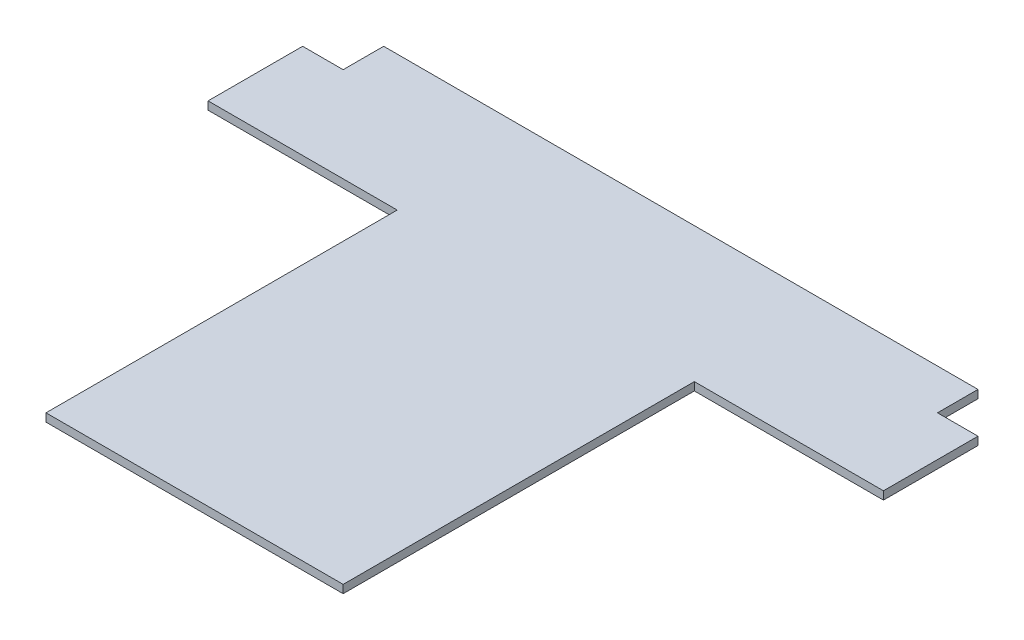
ISO-10303-21;
HEADER;
FILE_DESCRIPTION(('STEP AP214'),'2;1');
FILE_NAME('part.step','',(''),(''),'','','');
FILE_SCHEMA(('AUTOMOTIVE_DESIGN { 1 0 10303 214 1 1 1 1 }'));
ENDSEC;
DATA;
#1=APPLICATION_CONTEXT('core data for automotive mechanical design processes');
#2=APPLICATION_PROTOCOL_DEFINITION('international standard','automotive_design',2000,#1);
#3=PRODUCT_CONTEXT('',#1,'mechanical');
#4=PRODUCT('Part','Part','',(#3));
#5=PRODUCT_RELATED_PRODUCT_CATEGORY('part','',(#4));
#6=PRODUCT_DEFINITION_FORMATION('','',#4);
#7=PRODUCT_DEFINITION_CONTEXT('part definition',#1,'design');
#8=PRODUCT_DEFINITION('design','',#6,#7);
#9=PRODUCT_DEFINITION_SHAPE('','',#8);
#10=(LENGTH_UNIT() NAMED_UNIT(*) SI_UNIT(.MILLI.,.METRE.));
#11=(NAMED_UNIT(*) PLANE_ANGLE_UNIT() SI_UNIT($,.RADIAN.));
#12=(NAMED_UNIT(*) SI_UNIT($,.STERADIAN.) SOLID_ANGLE_UNIT());
#13=UNCERTAINTY_MEASURE_WITH_UNIT(LENGTH_MEASURE(1.E-05),#10,'distance_accuracy_value','');
#14=(GEOMETRIC_REPRESENTATION_CONTEXT(3) GLOBAL_UNCERTAINTY_ASSIGNED_CONTEXT((#13)) GLOBAL_UNIT_ASSIGNED_CONTEXT((#10,
#11,#12)) REPRESENTATION_CONTEXT('',''));
#15=CARTESIAN_POINT('',(0.,0.,0.));
#16=DIRECTION('',(0.,0.,1.));
#17=DIRECTION('',(1.,0.,0.));
#18=AXIS2_PLACEMENT_3D('',#15,#16,#17);
#19=CARTESIAN_POINT('',(-250.,6.,-150.));
#20=DIRECTION('',(0.,0.,1.));
#21=DIRECTION('',(1.,0.,0.));
#22=AXIS2_PLACEMENT_3D('',#19,#20,#21);
#23=PLANE('',#22);
#24=DIRECTION('',(-1.,0.,0.));
#25=VECTOR('',#24,1.);
#26=CARTESIAN_POINT('',(-250.,0.,-150.));
#27=LINE('',#26,#25);
#28=CARTESIAN_POINT('',(-220.,0.,-150.));
#29=VERTEX_POINT('',#28);
#30=CARTESIAN_POINT('',(-250.,0.,-150.));
#31=VERTEX_POINT('',#30);
#32=EDGE_CURVE('E163',#29,#31,#27,.T.);
#33=ORIENTED_EDGE('',*,*,#32,.T.);
#34=DIRECTION('',(0.,-1.,0.));
#35=VECTOR('',#34,1.);
#36=CARTESIAN_POINT('',(-250.,6.,-150.));
#37=LINE('',#36,#35);
#38=CARTESIAN_POINT('',(-250.,6.,-150.));
#39=VERTEX_POINT('',#38);
#40=EDGE_CURVE('E11',#39,#31,#37,.T.);
#41=ORIENTED_EDGE('',*,*,#40,.F.);
#42=DIRECTION('',(-1.,0.,0.));
#43=VECTOR('',#42,1.);
#44=CARTESIAN_POINT('',(-250.,6.,-150.));
#45=LINE('',#44,#43);
#46=CARTESIAN_POINT('',(-220.,6.,-150.));
#47=VERTEX_POINT('',#46);
#48=EDGE_CURVE('E185',#47,#39,#45,.T.);
#49=ORIENTED_EDGE('',*,*,#48,.F.);
#50=DIRECTION('',(0.,-1.,0.));
#51=VECTOR('',#50,1.);
#52=CARTESIAN_POINT('',(-220.,6.,-150.));
#53=LINE('',#52,#51);
#54=EDGE_CURVE('E159',#47,#29,#53,.T.);
#55=ORIENTED_EDGE('',*,*,#54,.T.);
#56=EDGE_LOOP('',(#33,#41,#49,#55));
#57=FACE_BOUND('',#56,.T.);
#58=ADVANCED_FACE('F43',(#57),#23,.F.);
#59=CARTESIAN_POINT('',(-250.,6.,-79.9999999999999));
#60=DIRECTION('',(1.,0.,0.));
#61=DIRECTION('',(0.,0.,-1.));
#62=AXIS2_PLACEMENT_3D('',#59,#60,#61);
#63=PLANE('',#62);
#64=DIRECTION('',(0.,0.,1.));
#65=VECTOR('',#64,1.);
#66=CARTESIAN_POINT('',(-250.,0.,-79.9999999999999));
#67=LINE('',#66,#65);
#68=CARTESIAN_POINT('',(-250.,0.,-79.9999999999999));
#69=VERTEX_POINT('',#68);
#70=EDGE_CURVE('E166',#31,#69,#67,.T.);
#71=ORIENTED_EDGE('',*,*,#70,.T.);
#72=DIRECTION('',(0.,-1.,0.));
#73=VECTOR('',#72,1.);
#74=CARTESIAN_POINT('',(-250.,6.,-79.9999999999999));
#75=LINE('',#74,#73);
#76=CARTESIAN_POINT('',(-250.,6.,-79.9999999999999));
#77=VERTEX_POINT('',#76);
#78=EDGE_CURVE('E51',#77,#69,#75,.T.);
#79=ORIENTED_EDGE('',*,*,#78,.F.);
#80=DIRECTION('',(0.,0.,1.));
#81=VECTOR('',#80,1.);
#82=CARTESIAN_POINT('',(-250.,6.,-79.9999999999999));
#83=LINE('',#82,#81);
#84=EDGE_CURVE('E114',#39,#77,#83,.T.);
#85=ORIENTED_EDGE('',*,*,#84,.F.);
#86=ORIENTED_EDGE('',*,*,#40,.T.);
#87=EDGE_LOOP('',(#71,#79,#85,#86));
#88=FACE_BOUND('',#87,.T.);
#89=ADVANCED_FACE('F263',(#88),#63,.F.);
#90=CARTESIAN_POINT('',(-110.,6.,-79.9999999999999));
#91=DIRECTION('',(0.,0.,-1.));
#92=DIRECTION('',(-1.,0.,0.));
#93=AXIS2_PLACEMENT_3D('',#90,#91,#92);
#94=PLANE('',#93);
#95=DIRECTION('',(1.,0.,0.));
#96=VECTOR('',#95,1.);
#97=CARTESIAN_POINT('',(-110.,0.,-79.9999999999999));
#98=LINE('',#97,#96);
#99=CARTESIAN_POINT('',(-110.,0.,-79.9999999999999));
#100=VERTEX_POINT('',#99);
#101=EDGE_CURVE('E168',#69,#100,#98,.T.);
#102=ORIENTED_EDGE('',*,*,#101,.T.);
#103=DIRECTION('',(0.,-1.,0.));
#104=VECTOR('',#103,1.);
#105=CARTESIAN_POINT('',(-110.,6.,-79.9999999999999));
#106=LINE('',#105,#104);
#107=CARTESIAN_POINT('',(-110.,6.,-79.9999999999999));
#108=VERTEX_POINT('',#107);
#109=EDGE_CURVE('E204',#108,#100,#106,.T.);
#110=ORIENTED_EDGE('',*,*,#109,.F.);
#111=DIRECTION('',(1.,0.,0.));
#112=VECTOR('',#111,1.);
#113=CARTESIAN_POINT('',(-110.,6.,-79.9999999999999));
#114=LINE('',#113,#112);
#115=EDGE_CURVE('E212',#77,#108,#114,.T.);
#116=ORIENTED_EDGE('',*,*,#115,.F.);
#117=ORIENTED_EDGE('',*,*,#78,.T.);
#118=EDGE_LOOP('',(#102,#110,#116,#117));
#119=FACE_BOUND('',#118,.T.);
#120=ADVANCED_FACE('F210',(#119),#94,.F.);
#121=CARTESIAN_POINT('',(-110.,6.,180.));
#122=DIRECTION('',(1.,0.,0.));
#123=DIRECTION('',(0.,0.,-1.));
#124=AXIS2_PLACEMENT_3D('',#121,#122,#123);
#125=PLANE('',#124);
#126=DIRECTION('',(0.,0.,1.));
#127=VECTOR('',#126,1.);
#128=CARTESIAN_POINT('',(-110.,0.,180.));
#129=LINE('',#128,#127);
#130=CARTESIAN_POINT('',(-110.,0.,180.));
#131=VERTEX_POINT('',#130);
#132=EDGE_CURVE('E170',#100,#131,#129,.T.);
#133=ORIENTED_EDGE('',*,*,#132,.T.);
#134=DIRECTION('',(0.,-1.,0.));
#135=VECTOR('',#134,1.);
#136=CARTESIAN_POINT('',(-110.,6.,180.));
#137=LINE('',#136,#135);
#138=CARTESIAN_POINT('',(-110.,6.,180.));
#139=VERTEX_POINT('',#138);
#140=EDGE_CURVE('E201',#139,#131,#137,.T.);
#141=ORIENTED_EDGE('',*,*,#140,.F.);
#142=DIRECTION('',(0.,0.,1.));
#143=VECTOR('',#142,1.);
#144=CARTESIAN_POINT('',(-110.,6.,180.));
#145=LINE('',#144,#143);
#146=EDGE_CURVE('E230',#108,#139,#145,.T.);
#147=ORIENTED_EDGE('',*,*,#146,.F.);
#148=ORIENTED_EDGE('',*,*,#109,.T.);
#149=EDGE_LOOP('',(#133,#141,#147,#148));
#150=FACE_BOUND('',#149,.T.);
#151=ADVANCED_FACE('F221',(#150),#125,.F.);
#152=CARTESIAN_POINT('',(110.,6.,180.));
#153=DIRECTION('',(0.,0.,-1.));
#154=DIRECTION('',(-1.,0.,0.));
#155=AXIS2_PLACEMENT_3D('',#152,#153,#154);
#156=PLANE('',#155);
#157=DIRECTION('',(1.,0.,0.));
#158=VECTOR('',#157,1.);
#159=CARTESIAN_POINT('',(110.,0.,180.));
#160=LINE('',#159,#158);
#161=CARTESIAN_POINT('',(110.,0.,180.));
#162=VERTEX_POINT('',#161);
#163=EDGE_CURVE('E172',#131,#162,#160,.T.);
#164=ORIENTED_EDGE('',*,*,#163,.T.);
#165=DIRECTION('',(0.,-1.,0.));
#166=VECTOR('',#165,1.);
#167=CARTESIAN_POINT('',(110.,6.,180.));
#168=LINE('',#167,#166);
#169=CARTESIAN_POINT('',(110.,6.,180.));
#170=VERTEX_POINT('',#169);
#171=EDGE_CURVE('E198',#170,#162,#168,.T.);
#172=ORIENTED_EDGE('',*,*,#171,.F.);
#173=DIRECTION('',(1.,0.,0.));
#174=VECTOR('',#173,1.);
#175=CARTESIAN_POINT('',(110.,6.,180.));
#176=LINE('',#175,#174);
#177=EDGE_CURVE('E227',#139,#170,#176,.T.);
#178=ORIENTED_EDGE('',*,*,#177,.F.);
#179=ORIENTED_EDGE('',*,*,#140,.T.);
#180=EDGE_LOOP('',(#164,#172,#178,#179));
#181=FACE_BOUND('',#180,.T.);
#182=ADVANCED_FACE('F225',(#181),#156,.F.);
#183=CARTESIAN_POINT('',(110.,6.,-80.));
#184=DIRECTION('',(-1.,0.,0.));
#185=DIRECTION('',(0.,0.,1.));
#186=AXIS2_PLACEMENT_3D('',#183,#184,#185);
#187=PLANE('',#186);
#188=DIRECTION('',(0.,0.,-1.));
#189=VECTOR('',#188,1.);
#190=CARTESIAN_POINT('',(110.,0.,-80.));
#191=LINE('',#190,#189);
#192=CARTESIAN_POINT('',(110.,0.,-80.));
#193=VERTEX_POINT('',#192);
#194=EDGE_CURVE('E174',#162,#193,#191,.T.);
#195=ORIENTED_EDGE('',*,*,#194,.T.);
#196=DIRECTION('',(0.,-1.,0.));
#197=VECTOR('',#196,1.);
#198=CARTESIAN_POINT('',(110.,6.,-80.));
#199=LINE('',#198,#197);
#200=CARTESIAN_POINT('',(110.,6.,-80.));
#201=VERTEX_POINT('',#200);
#202=EDGE_CURVE('E195',#201,#193,#199,.T.);
#203=ORIENTED_EDGE('',*,*,#202,.F.);
#204=DIRECTION('',(0.,0.,-1.));
#205=VECTOR('',#204,1.);
#206=CARTESIAN_POINT('',(110.,6.,-80.));
#207=LINE('',#206,#205);
#208=EDGE_CURVE('E229',#170,#201,#207,.T.);
#209=ORIENTED_EDGE('',*,*,#208,.F.);
#210=ORIENTED_EDGE('',*,*,#171,.T.);
#211=EDGE_LOOP('',(#195,#203,#209,#210));
#212=FACE_BOUND('',#211,.T.);
#213=ADVANCED_FACE('F276',(#212),#187,.F.);
#214=CARTESIAN_POINT('',(250.,6.,-80.));
#215=DIRECTION('',(0.,0.,-1.));
#216=DIRECTION('',(-1.,0.,0.));
#217=AXIS2_PLACEMENT_3D('',#214,#215,#216);
#218=PLANE('',#217);
#219=DIRECTION('',(1.,0.,0.));
#220=VECTOR('',#219,1.);
#221=CARTESIAN_POINT('',(250.,0.,-80.));
#222=LINE('',#221,#220);
#223=CARTESIAN_POINT('',(250.,0.,-80.));
#224=VERTEX_POINT('',#223);
#225=EDGE_CURVE('E176',#193,#224,#222,.T.);
#226=ORIENTED_EDGE('',*,*,#225,.T.);
#227=DIRECTION('',(0.,-1.,0.));
#228=VECTOR('',#227,1.);
#229=CARTESIAN_POINT('',(250.,6.,-80.));
#230=LINE('',#229,#228);
#231=CARTESIAN_POINT('',(250.,6.,-80.));
#232=VERTEX_POINT('',#231);
#233=EDGE_CURVE('E192',#232,#224,#230,.T.);
#234=ORIENTED_EDGE('',*,*,#233,.F.);
#235=DIRECTION('',(1.,0.,0.));
#236=VECTOR('',#235,1.);
#237=CARTESIAN_POINT('',(250.,6.,-80.));
#238=LINE('',#237,#236);
#239=EDGE_CURVE('E232',#201,#232,#238,.T.);
#240=ORIENTED_EDGE('',*,*,#239,.F.);
#241=ORIENTED_EDGE('',*,*,#202,.T.);
#242=EDGE_LOOP('',(#226,#234,#240,#241));
#243=FACE_BOUND('',#242,.T.);
#244=ADVANCED_FACE('F279',(#243),#218,.F.);
#245=CARTESIAN_POINT('',(250.,6.,-150.));
#246=DIRECTION('',(-1.,0.,0.));
#247=DIRECTION('',(0.,0.,1.));
#248=AXIS2_PLACEMENT_3D('',#245,#246,#247);
#249=PLANE('',#248);
#250=DIRECTION('',(0.,0.,-1.));
#251=VECTOR('',#250,1.);
#252=CARTESIAN_POINT('',(250.,0.,-150.));
#253=LINE('',#252,#251);
#254=CARTESIAN_POINT('',(250.,0.,-150.));
#255=VERTEX_POINT('',#254);
#256=EDGE_CURVE('E178',#224,#255,#253,.T.);
#257=ORIENTED_EDGE('',*,*,#256,.T.);
#258=DIRECTION('',(0.,-1.,0.));
#259=VECTOR('',#258,1.);
#260=CARTESIAN_POINT('',(250.,6.,-150.));
#261=LINE('',#260,#259);
#262=CARTESIAN_POINT('',(250.,6.,-150.));
#263=VERTEX_POINT('',#262);
#264=EDGE_CURVE('E189',#263,#255,#261,.T.);
#265=ORIENTED_EDGE('',*,*,#264,.F.);
#266=DIRECTION('',(0.,0.,-1.));
#267=VECTOR('',#266,1.);
#268=CARTESIAN_POINT('',(250.,6.,-150.));
#269=LINE('',#268,#267);
#270=EDGE_CURVE('E238',#232,#263,#269,.T.);
#271=ORIENTED_EDGE('',*,*,#270,.F.);
#272=ORIENTED_EDGE('',*,*,#233,.T.);
#273=EDGE_LOOP('',(#257,#265,#271,#272));
#274=FACE_BOUND('',#273,.T.);
#275=ADVANCED_FACE('F244',(#274),#249,.F.);
#276=CARTESIAN_POINT('',(220.,6.,-150.));
#277=DIRECTION('',(0.,0.,1.));
#278=DIRECTION('',(1.,0.,0.));
#279=AXIS2_PLACEMENT_3D('',#276,#277,#278);
#280=PLANE('',#279);
#281=DIRECTION('',(-1.,0.,0.));
#282=VECTOR('',#281,1.);
#283=CARTESIAN_POINT('',(220.,0.,-150.));
#284=LINE('',#283,#282);
#285=CARTESIAN_POINT('',(220.,0.,-150.));
#286=VERTEX_POINT('',#285);
#287=EDGE_CURVE('E180',#255,#286,#284,.T.);
#288=ORIENTED_EDGE('',*,*,#287,.T.);
#289=DIRECTION('',(0.,-1.,0.));
#290=VECTOR('',#289,1.);
#291=CARTESIAN_POINT('',(220.,6.,-150.));
#292=LINE('',#291,#290);
#293=CARTESIAN_POINT('',(220.,6.,-150.));
#294=VERTEX_POINT('',#293);
#295=EDGE_CURVE('E154',#294,#286,#292,.T.);
#296=ORIENTED_EDGE('',*,*,#295,.F.);
#297=DIRECTION('',(-1.,0.,0.));
#298=VECTOR('',#297,1.);
#299=CARTESIAN_POINT('',(220.,6.,-150.));
#300=LINE('',#299,#298);
#301=EDGE_CURVE('E145',#263,#294,#300,.T.);
#302=ORIENTED_EDGE('',*,*,#301,.F.);
#303=ORIENTED_EDGE('',*,*,#264,.T.);
#304=EDGE_LOOP('',(#288,#296,#302,#303));
#305=FACE_BOUND('',#304,.T.);
#306=ADVANCED_FACE('F248',(#305),#280,.F.);
#307=CARTESIAN_POINT('',(220.,6.,-180.));
#308=DIRECTION('',(-1.,0.,0.));
#309=DIRECTION('',(0.,0.,1.));
#310=AXIS2_PLACEMENT_3D('',#307,#308,#309);
#311=PLANE('',#310);
#312=DIRECTION('',(0.,0.,-1.));
#313=VECTOR('',#312,1.);
#314=CARTESIAN_POINT('',(220.,0.,-180.));
#315=LINE('',#314,#313);
#316=CARTESIAN_POINT('',(220.,0.,-180.));
#317=VERTEX_POINT('',#316);
#318=EDGE_CURVE('E153',#286,#317,#315,.T.);
#319=ORIENTED_EDGE('',*,*,#318,.T.);
#320=DIRECTION('',(0.,-1.,0.));
#321=VECTOR('',#320,1.);
#322=CARTESIAN_POINT('',(220.,6.,-180.));
#323=LINE('',#322,#321);
#324=CARTESIAN_POINT('',(220.,6.,-180.));
#325=VERTEX_POINT('',#324);
#326=EDGE_CURVE('E150',#325,#317,#323,.T.);
#327=ORIENTED_EDGE('',*,*,#326,.F.);
#328=DIRECTION('',(0.,0.,-1.));
#329=VECTOR('',#328,1.);
#330=CARTESIAN_POINT('',(220.,6.,-180.));
#331=LINE('',#330,#329);
#332=EDGE_CURVE('E139',#294,#325,#331,.T.);
#333=ORIENTED_EDGE('',*,*,#332,.F.);
#334=ORIENTED_EDGE('',*,*,#295,.T.);
#335=EDGE_LOOP('',(#319,#327,#333,#334));
#336=FACE_BOUND('',#335,.T.);
#337=ADVANCED_FACE('F151',(#336),#311,.F.);
#338=CARTESIAN_POINT('',(-220.,6.,-180.));
#339=DIRECTION('',(0.,0.,1.));
#340=DIRECTION('',(1.,0.,0.));
#341=AXIS2_PLACEMENT_3D('',#338,#339,#340);
#342=PLANE('',#341);
#343=DIRECTION('',(-1.,0.,0.));
#344=VECTOR('',#343,1.);
#345=CARTESIAN_POINT('',(-220.,0.,-180.));
#346=LINE('',#345,#344);
#347=CARTESIAN_POINT('',(-220.,0.,-180.));
#348=VERTEX_POINT('',#347);
#349=EDGE_CURVE('E100',#317,#348,#346,.T.);
#350=ORIENTED_EDGE('',*,*,#349,.T.);
#351=DIRECTION('',(0.,-1.,0.));
#352=VECTOR('',#351,1.);
#353=CARTESIAN_POINT('',(-220.,6.,-180.));
#354=LINE('',#353,#352);
#355=CARTESIAN_POINT('',(-220.,6.,-180.));
#356=VERTEX_POINT('',#355);
#357=EDGE_CURVE('E155',#356,#348,#354,.T.);
#358=ORIENTED_EDGE('',*,*,#357,.F.);
#359=DIRECTION('',(-1.,0.,0.));
#360=VECTOR('',#359,1.);
#361=CARTESIAN_POINT('',(-220.,6.,-180.));
#362=LINE('',#361,#360);
#363=EDGE_CURVE('E143',#325,#356,#362,.T.);
#364=ORIENTED_EDGE('',*,*,#363,.F.);
#365=ORIENTED_EDGE('',*,*,#326,.T.);
#366=EDGE_LOOP('',(#350,#358,#364,#365));
#367=FACE_BOUND('',#366,.T.);
#368=ADVANCED_FACE('F157',(#367),#342,.F.);
#369=CARTESIAN_POINT('',(-220.,6.,-150.));
#370=DIRECTION('',(1.,0.,0.));
#371=DIRECTION('',(0.,0.,-1.));
#372=AXIS2_PLACEMENT_3D('',#369,#370,#371);
#373=PLANE('',#372);
#374=DIRECTION('',(0.,0.,1.));
#375=VECTOR('',#374,1.);
#376=CARTESIAN_POINT('',(-220.,0.,-150.));
#377=LINE('',#376,#375);
#378=EDGE_CURVE('E106',#348,#29,#377,.T.);
#379=ORIENTED_EDGE('',*,*,#378,.T.);
#380=ORIENTED_EDGE('',*,*,#54,.F.);
#381=DIRECTION('',(0.,0.,1.));
#382=VECTOR('',#381,1.);
#383=CARTESIAN_POINT('',(-220.,6.,-150.));
#384=LINE('',#383,#382);
#385=EDGE_CURVE('E59',#356,#47,#384,.T.);
#386=ORIENTED_EDGE('',*,*,#385,.F.);
#387=ORIENTED_EDGE('',*,*,#357,.T.);
#388=EDGE_LOOP('',(#379,#380,#386,#387));
#389=FACE_BOUND('',#388,.T.);
#390=ADVANCED_FACE('F252',(#389),#373,.F.);
#391=CARTESIAN_POINT('',(0.,6.,0.));
#392=DIRECTION('',(0.,1.,0.));
#393=DIRECTION('',(0.,0.,1.));
#394=AXIS2_PLACEMENT_3D('',#391,#392,#393);
#395=PLANE('',#394);
#396=ORIENTED_EDGE('',*,*,#48,.T.);
#397=ORIENTED_EDGE('',*,*,#84,.T.);
#398=ORIENTED_EDGE('',*,*,#115,.T.);
#399=ORIENTED_EDGE('',*,*,#146,.T.);
#400=ORIENTED_EDGE('',*,*,#177,.T.);
#401=ORIENTED_EDGE('',*,*,#208,.T.);
#402=ORIENTED_EDGE('',*,*,#239,.T.);
#403=ORIENTED_EDGE('',*,*,#270,.T.);
#404=ORIENTED_EDGE('',*,*,#301,.T.);
#405=ORIENTED_EDGE('',*,*,#332,.T.);
#406=ORIENTED_EDGE('',*,*,#363,.T.);
#407=ORIENTED_EDGE('',*,*,#385,.T.);
#408=EDGE_LOOP('',(#396,#397,#398,#399,#400,#401,#402,#403,#404,#405,#406,#407));
#409=FACE_BOUND('',#408,.T.);
#410=ADVANCED_FACE('F141',(#409),#395,.T.);
#411=CARTESIAN_POINT('',(0.,0.,0.));
#412=DIRECTION('',(0.,1.,0.));
#413=DIRECTION('',(0.,0.,1.));
#414=AXIS2_PLACEMENT_3D('',#411,#412,#413);
#415=PLANE('',#414);
#416=ORIENTED_EDGE('',*,*,#32,.F.);
#417=ORIENTED_EDGE('',*,*,#378,.F.);
#418=ORIENTED_EDGE('',*,*,#349,.F.);
#419=ORIENTED_EDGE('',*,*,#318,.F.);
#420=ORIENTED_EDGE('',*,*,#287,.F.);
#421=ORIENTED_EDGE('',*,*,#256,.F.);
#422=ORIENTED_EDGE('',*,*,#225,.F.);
#423=ORIENTED_EDGE('',*,*,#194,.F.);
#424=ORIENTED_EDGE('',*,*,#163,.F.);
#425=ORIENTED_EDGE('',*,*,#132,.F.);
#426=ORIENTED_EDGE('',*,*,#101,.F.);
#427=ORIENTED_EDGE('',*,*,#70,.F.);
#428=EDGE_LOOP('',(#416,#417,#418,#419,#420,#421,#422,#423,#424,#425,#426,#427));
#429=FACE_BOUND('',#428,.T.);
#430=ADVANCED_FACE('F216',(#429),#415,.F.);
#431=CLOSED_SHELL('',(#58,#89,#120,#151,#182,#213,#244,#275,#306,#337,#368,#390,#410,#430));
#432=MANIFOLD_SOLID_BREP('B2',#431);
#433=ADVANCED_BREP_SHAPE_REPRESENTATION('',(#18,#432),#14);
#434=SHAPE_DEFINITION_REPRESENTATION(#9,#433);
ENDSEC;
END-ISO-10303-21;
